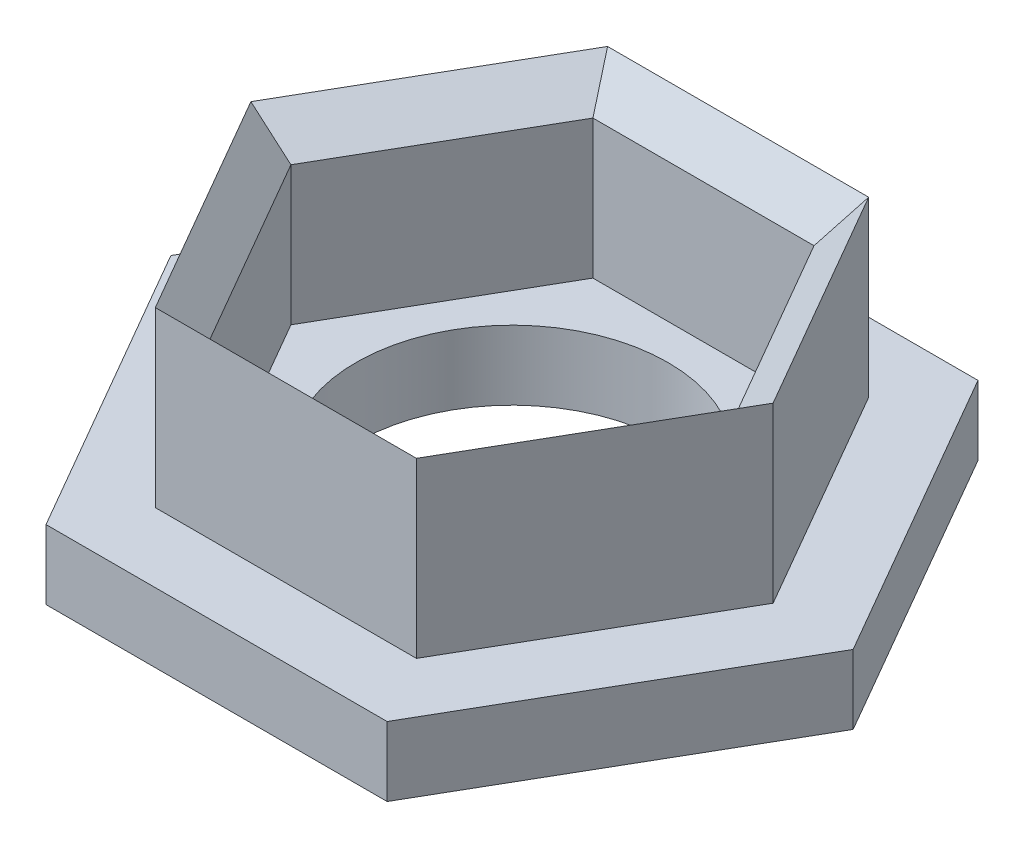
ISO-10303-21;
HEADER;
FILE_DESCRIPTION(('STEP AP214'),'2;1');
FILE_NAME('part.step','',(''),(''),'','','');
FILE_SCHEMA(('AUTOMOTIVE_DESIGN { 1 0 10303 214 1 1 1 1 }'));
ENDSEC;
DATA;
#1=APPLICATION_CONTEXT('core data for automotive mechanical design processes');
#2=APPLICATION_PROTOCOL_DEFINITION('international standard','automotive_design',2000,#1);
#3=PRODUCT_CONTEXT('',#1,'mechanical');
#4=PRODUCT('Part','Part','',(#3));
#5=PRODUCT_RELATED_PRODUCT_CATEGORY('part','',(#4));
#6=PRODUCT_DEFINITION_FORMATION('','',#4);
#7=PRODUCT_DEFINITION_CONTEXT('part definition',#1,'design');
#8=PRODUCT_DEFINITION('design','',#6,#7);
#9=PRODUCT_DEFINITION_SHAPE('','',#8);
#10=(LENGTH_UNIT() NAMED_UNIT(*) SI_UNIT(.MILLI.,.METRE.));
#11=(NAMED_UNIT(*) PLANE_ANGLE_UNIT() SI_UNIT($,.RADIAN.));
#12=(NAMED_UNIT(*) SI_UNIT($,.STERADIAN.) SOLID_ANGLE_UNIT());
#13=UNCERTAINTY_MEASURE_WITH_UNIT(LENGTH_MEASURE(1.E-05),#10,'distance_accuracy_value','');
#14=(GEOMETRIC_REPRESENTATION_CONTEXT(3) GLOBAL_UNCERTAINTY_ASSIGNED_CONTEXT((#13)) GLOBAL_UNIT_ASSIGNED_CONTEXT((#10,
#11,#12)) REPRESENTATION_CONTEXT('',''));
#15=CARTESIAN_POINT('',(0.,0.,0.));
#16=DIRECTION('',(0.,0.,1.));
#17=DIRECTION('',(1.,0.,0.));
#18=AXIS2_PLACEMENT_3D('',#15,#16,#17);
#19=CARTESIAN_POINT('',(0.,0.,0.));
#20=DIRECTION('',(0.,-1.,0.));
#21=DIRECTION('',(0.,0.,-1.));
#22=AXIS2_PLACEMENT_3D('',#19,#20,#21);
#23=PLANE('',#22);
#24=CARTESIAN_POINT('',(0.,0.,0.));
#25=DIRECTION('',(0.,-1.,0.));
#26=DIRECTION('',(0.,0.,-1.));
#27=AXIS2_PLACEMENT_3D('',#24,#25,#26);
#28=CIRCLE('',#27,4.5);
#29=CARTESIAN_POINT('',(0.,0.,-4.5));
#30=VERTEX_POINT('',#29);
#31=EDGE_CURVE('E249',#30,#30,#28,.T.);
#32=ORIENTED_EDGE('',*,*,#31,.T.);
#33=EDGE_LOOP('',(#32));
#34=FACE_BOUND('',#33,.T.);
#35=DIRECTION('',(-0.5,0.,0.866025403784439));
#36=VECTOR('',#35,1.);
#37=CARTESIAN_POINT('',(6.37972047454537,0.,0.));
#38=LINE('',#37,#36);
#39=CARTESIAN_POINT('',(6.37972047454537,0.,0.));
#40=VERTEX_POINT('',#39);
#41=CARTESIAN_POINT('',(3.18986023727269,0.,5.525));
#42=VERTEX_POINT('',#41);
#43=EDGE_CURVE('E191',#40,#42,#38,.T.);
#44=ORIENTED_EDGE('',*,*,#43,.F.);
#45=DIRECTION('',(0.5,0.,0.866025403784438));
#46=VECTOR('',#45,1.);
#47=CARTESIAN_POINT('',(3.18986023727268,0.,-5.525));
#48=LINE('',#47,#46);
#49=CARTESIAN_POINT('',(3.18986023727268,0.,-5.525));
#50=VERTEX_POINT('',#49);
#51=EDGE_CURVE('E199',#50,#40,#48,.T.);
#52=ORIENTED_EDGE('',*,*,#51,.F.);
#53=DIRECTION('',(1.,0.,0.));
#54=VECTOR('',#53,1.);
#55=CARTESIAN_POINT('',(-3.18986023727268,0.,-5.525));
#56=LINE('',#55,#54);
#57=CARTESIAN_POINT('',(-3.18986023727269,0.,-5.525));
#58=VERTEX_POINT('',#57);
#59=EDGE_CURVE('E196',#58,#50,#56,.T.);
#60=ORIENTED_EDGE('',*,*,#59,.F.);
#61=DIRECTION('',(0.5,0.,-0.866025403784438));
#62=VECTOR('',#61,1.);
#63=CARTESIAN_POINT('',(-6.37972047454537,0.,0.));
#64=LINE('',#63,#62);
#65=CARTESIAN_POINT('',(-6.37972047454537,0.,0.));
#66=VERTEX_POINT('',#65);
#67=EDGE_CURVE('E187',#66,#58,#64,.T.);
#68=ORIENTED_EDGE('',*,*,#67,.F.);
#69=DIRECTION('',(-0.5,0.,-0.866025403784439));
#70=VECTOR('',#69,1.);
#71=CARTESIAN_POINT('',(-3.18986023727268,0.,5.525));
#72=LINE('',#71,#70);
#73=CARTESIAN_POINT('',(-3.18986023727268,0.,5.525));
#74=VERTEX_POINT('',#73);
#75=EDGE_CURVE('E169',#74,#66,#72,.T.);
#76=ORIENTED_EDGE('',*,*,#75,.F.);
#77=DIRECTION('',(-1.,0.,0.));
#78=VECTOR('',#77,1.);
#79=CARTESIAN_POINT('',(3.18986023727269,0.,5.525));
#80=LINE('',#79,#78);
#81=EDGE_CURVE('E183',#42,#74,#80,.T.);
#82=ORIENTED_EDGE('',*,*,#81,.F.);
#83=EDGE_LOOP('',(#44,#52,#60,#68,#76,#82));
#84=FACE_BOUND('',#83,.T.);
#85=ADVANCED_FACE('F38',(#34,#84),#23,.F.);
#86=CARTESIAN_POINT('',(0.,-2.,0.));
#87=DIRECTION('',(0.,-1.,0.));
#88=DIRECTION('',(0.,0.,-1.));
#89=AXIS2_PLACEMENT_3D('',#86,#87,#88);
#90=PLANE('',#89);
#91=DIRECTION('',(0.5,0.,-0.866025403784439));
#92=VECTOR('',#91,1.);
#93=CARTESIAN_POINT('',(-9.84382208968312,-2.,0.));
#94=LINE('',#93,#92);
#95=CARTESIAN_POINT('',(-9.84382208968312,-2.,0.));
#96=VERTEX_POINT('',#95);
#97=CARTESIAN_POINT('',(-4.92191104484156,-2.,-8.525));
#98=VERTEX_POINT('',#97);
#99=EDGE_CURVE('E266',#96,#98,#94,.T.);
#100=ORIENTED_EDGE('',*,*,#99,.T.);
#101=DIRECTION('',(1.,0.,0.));
#102=VECTOR('',#101,1.);
#103=CARTESIAN_POINT('',(-4.92191104484156,-2.,-8.525));
#104=LINE('',#103,#102);
#105=CARTESIAN_POINT('',(4.92191104484156,-2.,-8.525));
#106=VERTEX_POINT('',#105);
#107=EDGE_CURVE('E269',#98,#106,#104,.T.);
#108=ORIENTED_EDGE('',*,*,#107,.T.);
#109=DIRECTION('',(0.5,0.,0.866025403784438));
#110=VECTOR('',#109,1.);
#111=CARTESIAN_POINT('',(4.92191104484156,-2.,-8.525));
#112=LINE('',#111,#110);
#113=CARTESIAN_POINT('',(9.84382208968312,-2.,0.));
#114=VERTEX_POINT('',#113);
#115=EDGE_CURVE('E272',#106,#114,#112,.T.);
#116=ORIENTED_EDGE('',*,*,#115,.T.);
#117=DIRECTION('',(-0.5,0.,0.866025403784439));
#118=VECTOR('',#117,1.);
#119=CARTESIAN_POINT('',(9.84382208968312,-2.,0.));
#120=LINE('',#119,#118);
#121=CARTESIAN_POINT('',(4.92191104484157,-2.,8.525));
#122=VERTEX_POINT('',#121);
#123=EDGE_CURVE('E274',#114,#122,#120,.T.);
#124=ORIENTED_EDGE('',*,*,#123,.T.);
#125=DIRECTION('',(-1.,0.,0.));
#126=VECTOR('',#125,1.);
#127=CARTESIAN_POINT('',(4.92191104484157,-2.,8.525));
#128=LINE('',#127,#126);
#129=CARTESIAN_POINT('',(-4.92191104484156,-2.,8.525));
#130=VERTEX_POINT('',#129);
#131=EDGE_CURVE('E276',#122,#130,#128,.T.);
#132=ORIENTED_EDGE('',*,*,#131,.T.);
#133=DIRECTION('',(-0.5,0.,-0.866025403784438));
#134=VECTOR('',#133,1.);
#135=CARTESIAN_POINT('',(-4.92191104484156,-2.,8.525));
#136=LINE('',#135,#134);
#137=EDGE_CURVE('E278',#130,#96,#136,.T.);
#138=ORIENTED_EDGE('',*,*,#137,.T.);
#139=EDGE_LOOP('',(#100,#108,#116,#124,#132,#138));
#140=FACE_BOUND('',#139,.T.);
#141=CARTESIAN_POINT('',(0.,-2.,0.));
#142=DIRECTION('',(0.,-1.,0.));
#143=DIRECTION('',(0.,0.,-1.));
#144=AXIS2_PLACEMENT_3D('',#141,#142,#143);
#145=CIRCLE('',#144,4.5);
#146=CARTESIAN_POINT('',(0.,-2.,-4.5));
#147=VERTEX_POINT('',#146);
#148=EDGE_CURVE('E260',#147,#147,#145,.T.);
#149=ORIENTED_EDGE('',*,*,#148,.F.);
#150=EDGE_LOOP('',(#149));
#151=FACE_BOUND('',#150,.T.);
#152=ADVANCED_FACE('F383',(#140,#151),#90,.T.);
#153=DIRECTION('',(1.,0.,0.));
#154=VECTOR('',#153,1.);
#155=CARTESIAN_POINT('',(-3.76721050646231,0.,-6.525));
#156=LINE('',#155,#154);
#157=CARTESIAN_POINT('',(-3.76721050646231,0.,-6.525));
#158=VERTEX_POINT('',#157);
#159=CARTESIAN_POINT('',(3.76721050646231,0.,-6.525));
#160=VERTEX_POINT('',#159);
#161=EDGE_CURVE('E215',#158,#160,#156,.T.);
#162=ORIENTED_EDGE('',*,*,#161,.T.);
#163=DIRECTION('',(0.5,0.,0.866025403784439));
#164=VECTOR('',#163,1.);
#165=CARTESIAN_POINT('',(3.76721050646231,0.,-6.525));
#166=LINE('',#165,#164);
#167=CARTESIAN_POINT('',(7.53442101292462,0.,0.));
#168=VERTEX_POINT('',#167);
#169=EDGE_CURVE('E204',#160,#168,#166,.T.);
#170=ORIENTED_EDGE('',*,*,#169,.T.);
#171=DIRECTION('',(-0.5,0.,0.866025403784439));
#172=VECTOR('',#171,1.);
#173=CARTESIAN_POINT('',(7.53442101292462,0.,0.));
#174=LINE('',#173,#172);
#175=CARTESIAN_POINT('',(3.76721050646231,0.,6.525));
#176=VERTEX_POINT('',#175);
#177=EDGE_CURVE('E233',#168,#176,#174,.T.);
#178=ORIENTED_EDGE('',*,*,#177,.T.);
#179=DIRECTION('',(-1.,0.,0.));
#180=VECTOR('',#179,1.);
#181=CARTESIAN_POINT('',(3.76721050646231,0.,6.525));
#182=LINE('',#181,#180);
#183=CARTESIAN_POINT('',(-3.76721050646231,0.,6.525));
#184=VERTEX_POINT('',#183);
#185=EDGE_CURVE('E236',#176,#184,#182,.T.);
#186=ORIENTED_EDGE('',*,*,#185,.T.);
#187=DIRECTION('',(-0.5,0.,-0.866025403784439));
#188=VECTOR('',#187,1.);
#189=CARTESIAN_POINT('',(-3.76721050646231,0.,6.525));
#190=LINE('',#189,#188);
#191=CARTESIAN_POINT('',(-7.53442101292462,0.,0.));
#192=VERTEX_POINT('',#191);
#193=EDGE_CURVE('E239',#184,#192,#190,.T.);
#194=ORIENTED_EDGE('',*,*,#193,.T.);
#195=DIRECTION('',(0.5,0.,-0.866025403784438));
#196=VECTOR('',#195,1.);
#197=CARTESIAN_POINT('',(-7.53442101292462,0.,0.));
#198=LINE('',#197,#196);
#199=EDGE_CURVE('E242',#192,#158,#198,.T.);
#200=ORIENTED_EDGE('',*,*,#199,.T.);
#201=EDGE_LOOP('',(#162,#170,#178,#186,#194,#200));
#202=FACE_BOUND('',#201,.T.);
#203=DIRECTION('',(0.5,0.,-0.866025403784439));
#204=VECTOR('',#203,1.);
#205=CARTESIAN_POINT('',(-9.84382208968312,0.,0.));
#206=LINE('',#205,#204);
#207=CARTESIAN_POINT('',(-9.84382208968312,0.,0.));
#208=VERTEX_POINT('',#207);
#209=CARTESIAN_POINT('',(-4.92191104484156,0.,-8.525));
#210=VERTEX_POINT('',#209);
#211=EDGE_CURVE('E263',#208,#210,#206,.T.);
#212=ORIENTED_EDGE('',*,*,#211,.F.);
#213=DIRECTION('',(-0.5,0.,-0.866025403784438));
#214=VECTOR('',#213,1.);
#215=CARTESIAN_POINT('',(-4.92191104484156,0.,8.525));
#216=LINE('',#215,#214);
#217=CARTESIAN_POINT('',(-4.92191104484156,0.,8.525));
#218=VERTEX_POINT('',#217);
#219=EDGE_CURVE('E270',#218,#208,#216,.T.);
#220=ORIENTED_EDGE('',*,*,#219,.F.);
#221=DIRECTION('',(-1.,0.,0.));
#222=VECTOR('',#221,1.);
#223=CARTESIAN_POINT('',(4.92191104484157,0.,8.525));
#224=LINE('',#223,#222);
#225=CARTESIAN_POINT('',(4.92191104484157,0.,8.525));
#226=VERTEX_POINT('',#225);
#227=EDGE_CURVE('E289',#226,#218,#224,.T.);
#228=ORIENTED_EDGE('',*,*,#227,.F.);
#229=DIRECTION('',(-0.5,0.,0.866025403784439));
#230=VECTOR('',#229,1.);
#231=CARTESIAN_POINT('',(9.84382208968312,0.,0.));
#232=LINE('',#231,#230);
#233=CARTESIAN_POINT('',(9.84382208968312,0.,0.));
#234=VERTEX_POINT('',#233);
#235=EDGE_CURVE('E287',#234,#226,#232,.T.);
#236=ORIENTED_EDGE('',*,*,#235,.F.);
#237=DIRECTION('',(0.5,0.,0.866025403784438));
#238=VECTOR('',#237,1.);
#239=CARTESIAN_POINT('',(4.92191104484156,0.,-8.525));
#240=LINE('',#239,#238);
#241=CARTESIAN_POINT('',(4.92191104484156,0.,-8.525));
#242=VERTEX_POINT('',#241);
#243=EDGE_CURVE('E285',#242,#234,#240,.T.);
#244=ORIENTED_EDGE('',*,*,#243,.F.);
#245=DIRECTION('',(1.,0.,0.));
#246=VECTOR('',#245,1.);
#247=CARTESIAN_POINT('',(-4.92191104484156,0.,-8.525));
#248=LINE('',#247,#246);
#249=EDGE_CURVE('E283',#210,#242,#248,.T.);
#250=ORIENTED_EDGE('',*,*,#249,.F.);
#251=EDGE_LOOP('',(#212,#220,#228,#236,#244,#250));
#252=FACE_BOUND('',#251,.T.);
#253=ADVANCED_FACE('F379',(#202,#252),#23,.F.);
#254=CARTESIAN_POINT('',(-9.84382208968312,-2.,0.));
#255=DIRECTION('',(0.866025403784439,0.,0.5));
#256=DIRECTION('',(0.5,0.,-0.866025403784439));
#257=AXIS2_PLACEMENT_3D('',#254,#255,#256);
#258=PLANE('',#257);
#259=ORIENTED_EDGE('',*,*,#211,.T.);
#260=DIRECTION('',(0.,1.,0.));
#261=VECTOR('',#260,1.);
#262=CARTESIAN_POINT('',(-4.92191104484156,-2.,-8.525));
#263=LINE('',#262,#261);
#264=EDGE_CURVE('E306',#98,#210,#263,.T.);
#265=ORIENTED_EDGE('',*,*,#264,.F.);
#266=ORIENTED_EDGE('',*,*,#99,.F.);
#267=DIRECTION('',(0.,1.,0.));
#268=VECTOR('',#267,1.);
#269=CARTESIAN_POINT('',(-9.84382208968312,-2.,0.));
#270=LINE('',#269,#268);
#271=EDGE_CURVE('E280',#96,#208,#270,.T.);
#272=ORIENTED_EDGE('',*,*,#271,.T.);
#273=EDGE_LOOP('',(#259,#265,#266,#272));
#274=FACE_BOUND('',#273,.T.);
#275=ADVANCED_FACE('F382',(#274),#258,.F.);
#276=CARTESIAN_POINT('',(-4.92191104484156,-2.,-8.525));
#277=DIRECTION('',(0.,0.,1.));
#278=DIRECTION('',(1.,0.,0.));
#279=AXIS2_PLACEMENT_3D('',#276,#277,#278);
#280=PLANE('',#279);
#281=ORIENTED_EDGE('',*,*,#249,.T.);
#282=DIRECTION('',(0.,1.,0.));
#283=VECTOR('',#282,1.);
#284=CARTESIAN_POINT('',(4.92191104484156,-2.,-8.525));
#285=LINE('',#284,#283);
#286=EDGE_CURVE('E303',#106,#242,#285,.T.);
#287=ORIENTED_EDGE('',*,*,#286,.F.);
#288=ORIENTED_EDGE('',*,*,#107,.F.);
#289=ORIENTED_EDGE('',*,*,#264,.T.);
#290=EDGE_LOOP('',(#281,#287,#288,#289));
#291=FACE_BOUND('',#290,.T.);
#292=ADVANCED_FACE('F411',(#291),#280,.F.);
#293=CARTESIAN_POINT('',(4.92191104484156,-2.,-8.525));
#294=DIRECTION('',(-0.866025403784438,0.,0.5));
#295=DIRECTION('',(0.5,0.,0.866025403784438));
#296=AXIS2_PLACEMENT_3D('',#293,#294,#295);
#297=PLANE('',#296);
#298=ORIENTED_EDGE('',*,*,#243,.T.);
#299=DIRECTION('',(0.,1.,0.));
#300=VECTOR('',#299,1.);
#301=CARTESIAN_POINT('',(9.84382208968312,-2.,0.));
#302=LINE('',#301,#300);
#303=EDGE_CURVE('E300',#114,#234,#302,.T.);
#304=ORIENTED_EDGE('',*,*,#303,.F.);
#305=ORIENTED_EDGE('',*,*,#115,.F.);
#306=ORIENTED_EDGE('',*,*,#286,.T.);
#307=EDGE_LOOP('',(#298,#304,#305,#306));
#308=FACE_BOUND('',#307,.T.);
#309=ADVANCED_FACE('F408',(#308),#297,.F.);
#310=CARTESIAN_POINT('',(9.84382208968312,-2.,0.));
#311=DIRECTION('',(-0.866025403784439,0.,-0.5));
#312=DIRECTION('',(-0.5,0.,0.866025403784439));
#313=AXIS2_PLACEMENT_3D('',#310,#311,#312);
#314=PLANE('',#313);
#315=ORIENTED_EDGE('',*,*,#235,.T.);
#316=DIRECTION('',(0.,1.,0.));
#317=VECTOR('',#316,1.);
#318=CARTESIAN_POINT('',(4.92191104484157,-2.,8.525));
#319=LINE('',#318,#317);
#320=EDGE_CURVE('E297',#122,#226,#319,.T.);
#321=ORIENTED_EDGE('',*,*,#320,.F.);
#322=ORIENTED_EDGE('',*,*,#123,.F.);
#323=ORIENTED_EDGE('',*,*,#303,.T.);
#324=EDGE_LOOP('',(#315,#321,#322,#323));
#325=FACE_BOUND('',#324,.T.);
#326=ADVANCED_FACE('F403',(#325),#314,.F.);
#327=CARTESIAN_POINT('',(4.92191104484157,-2.,8.525));
#328=DIRECTION('',(0.,0.,-1.));
#329=DIRECTION('',(-1.,0.,0.));
#330=AXIS2_PLACEMENT_3D('',#327,#328,#329);
#331=PLANE('',#330);
#332=ORIENTED_EDGE('',*,*,#227,.T.);
#333=DIRECTION('',(0.,1.,0.));
#334=VECTOR('',#333,1.);
#335=CARTESIAN_POINT('',(-4.92191104484156,-2.,8.525));
#336=LINE('',#335,#334);
#337=EDGE_CURVE('E294',#130,#218,#336,.T.);
#338=ORIENTED_EDGE('',*,*,#337,.F.);
#339=ORIENTED_EDGE('',*,*,#131,.F.);
#340=ORIENTED_EDGE('',*,*,#320,.T.);
#341=EDGE_LOOP('',(#332,#338,#339,#340));
#342=FACE_BOUND('',#341,.T.);
#343=ADVANCED_FACE('F399',(#342),#331,.F.);
#344=CARTESIAN_POINT('',(-4.92191104484156,-2.,8.525));
#345=DIRECTION('',(0.866025403784438,0.,-0.5));
#346=DIRECTION('',(-0.5,0.,-0.866025403784439));
#347=AXIS2_PLACEMENT_3D('',#344,#345,#346);
#348=PLANE('',#347);
#349=ORIENTED_EDGE('',*,*,#219,.T.);
#350=ORIENTED_EDGE('',*,*,#271,.F.);
#351=ORIENTED_EDGE('',*,*,#137,.F.);
#352=ORIENTED_EDGE('',*,*,#337,.T.);
#353=EDGE_LOOP('',(#349,#350,#351,#352));
#354=FACE_BOUND('',#353,.T.);
#355=ADVANCED_FACE('F395',(#354),#348,.F.);
#356=CARTESIAN_POINT('',(0.,-2.,0.));
#357=DIRECTION('',(0.,1.,0.));
#358=DIRECTION('',(0.,0.,1.));
#359=AXIS2_PLACEMENT_3D('',#356,#357,#358);
#360=CYLINDRICAL_SURFACE('',#359,4.5);
#361=ORIENTED_EDGE('',*,*,#148,.T.);
#362=EDGE_LOOP('',(#361));
#363=FACE_BOUND('',#362,.T.);
#364=ORIENTED_EDGE('',*,*,#31,.F.);
#365=EDGE_LOOP('',(#364));
#366=FACE_BOUND('',#365,.T.);
#367=ADVANCED_FACE('F418',(#363,#366),#360,.F.);
#368=CARTESIAN_POINT('',(3.76721050646231,5.,-6.525));
#369=DIRECTION('',(0.866025403784439,0.,-0.5));
#370=DIRECTION('',(-0.5,0.,-0.866025403784439));
#371=AXIS2_PLACEMENT_3D('',#368,#369,#370);
#372=PLANE('',#371);
#373=ORIENTED_EDGE('',*,*,#169,.F.);
#374=DIRECTION('',(0.,-1.,0.));
#375=VECTOR('',#374,1.);
#376=CARTESIAN_POINT('',(3.76721050646231,5.,-6.525));
#377=LINE('',#376,#375);
#378=CARTESIAN_POINT('',(3.76721050646231,5.,-6.525));
#379=VERTEX_POINT('',#378);
#380=EDGE_CURVE('E247',#379,#160,#377,.T.);
#381=ORIENTED_EDGE('',*,*,#380,.F.);
#382=DIRECTION('',(0.5,0.,0.866025403784439));
#383=VECTOR('',#382,1.);
#384=CARTESIAN_POINT('',(3.76721050646231,5.,-6.525));
#385=LINE('',#384,#383);
#386=CARTESIAN_POINT('',(7.53442101292462,5.,0.));
#387=VERTEX_POINT('',#386);
#388=EDGE_CURVE('E211',#379,#387,#385,.T.);
#389=ORIENTED_EDGE('',*,*,#388,.T.);
#390=DIRECTION('',(0.,-1.,0.));
#391=VECTOR('',#390,1.);
#392=CARTESIAN_POINT('',(7.53442101292462,5.,0.));
#393=LINE('',#392,#391);
#394=EDGE_CURVE('E230',#387,#168,#393,.T.);
#395=ORIENTED_EDGE('',*,*,#394,.T.);
#396=EDGE_LOOP('',(#373,#381,#389,#395));
#397=FACE_BOUND('',#396,.T.);
#398=ADVANCED_FACE('F371',(#397),#372,.T.);
#399=CARTESIAN_POINT('',(-3.76721050646231,5.,-6.525));
#400=DIRECTION('',(0.,0.,-1.));
#401=DIRECTION('',(-1.,0.,0.));
#402=AXIS2_PLACEMENT_3D('',#399,#400,#401);
#403=PLANE('',#402);
#404=ORIENTED_EDGE('',*,*,#161,.F.);
#405=DIRECTION('',(0.,-1.,0.));
#406=VECTOR('',#405,1.);
#407=CARTESIAN_POINT('',(-3.76721050646231,5.,-6.525));
#408=LINE('',#407,#406);
#409=CARTESIAN_POINT('',(-3.76721050646231,5.,-6.525));
#410=VERTEX_POINT('',#409);
#411=EDGE_CURVE('E250',#410,#158,#408,.T.);
#412=ORIENTED_EDGE('',*,*,#411,.F.);
#413=DIRECTION('',(1.,0.,0.));
#414=VECTOR('',#413,1.);
#415=CARTESIAN_POINT('',(-3.76721050646231,5.,-6.525));
#416=LINE('',#415,#414);
#417=EDGE_CURVE('E227',#410,#379,#416,.T.);
#418=ORIENTED_EDGE('',*,*,#417,.T.);
#419=ORIENTED_EDGE('',*,*,#380,.T.);
#420=EDGE_LOOP('',(#404,#412,#418,#419));
#421=FACE_BOUND('',#420,.T.);
#422=ADVANCED_FACE('F374',(#421),#403,.T.);
#423=CARTESIAN_POINT('',(-7.53442101292462,5.,0.));
#424=DIRECTION('',(-0.866025403784439,0.,-0.5));
#425=DIRECTION('',(-0.5,0.,0.866025403784439));
#426=AXIS2_PLACEMENT_3D('',#423,#424,#425);
#427=PLANE('',#426);
#428=ORIENTED_EDGE('',*,*,#199,.F.);
#429=DIRECTION('',(0.,-1.,0.));
#430=VECTOR('',#429,1.);
#431=CARTESIAN_POINT('',(-7.53442101292462,5.,0.));
#432=LINE('',#431,#430);
#433=CARTESIAN_POINT('',(-7.53442101292462,5.,0.));
#434=VERTEX_POINT('',#433);
#435=EDGE_CURVE('E252',#434,#192,#432,.T.);
#436=ORIENTED_EDGE('',*,*,#435,.F.);
#437=DIRECTION('',(0.5,0.,-0.866025403784438));
#438=VECTOR('',#437,1.);
#439=CARTESIAN_POINT('',(-7.53442101292462,5.,0.));
#440=LINE('',#439,#438);
#441=EDGE_CURVE('E224',#434,#410,#440,.T.);
#442=ORIENTED_EDGE('',*,*,#441,.T.);
#443=ORIENTED_EDGE('',*,*,#411,.T.);
#444=EDGE_LOOP('',(#428,#436,#442,#443));
#445=FACE_BOUND('',#444,.T.);
#446=ADVANCED_FACE('F377',(#445),#427,.T.);
#447=CARTESIAN_POINT('',(-3.76721050646231,5.,6.525));
#448=DIRECTION('',(-0.866025403784439,0.,0.5));
#449=DIRECTION('',(0.5,0.,0.866025403784439));
#450=AXIS2_PLACEMENT_3D('',#447,#448,#449);
#451=PLANE('',#450);
#452=ORIENTED_EDGE('',*,*,#193,.F.);
#453=DIRECTION('',(0.,-1.,0.));
#454=VECTOR('',#453,1.);
#455=CARTESIAN_POINT('',(-3.76721050646231,5.,6.525));
#456=LINE('',#455,#454);
#457=CARTESIAN_POINT('',(-3.76721050646231,5.,6.525));
#458=VERTEX_POINT('',#457);
#459=EDGE_CURVE('E254',#458,#184,#456,.T.);
#460=ORIENTED_EDGE('',*,*,#459,.F.);
#461=DIRECTION('',(-0.5,0.,-0.866025403784439));
#462=VECTOR('',#461,1.);
#463=CARTESIAN_POINT('',(-3.76721050646231,5.,6.525));
#464=LINE('',#463,#462);
#465=EDGE_CURVE('E221',#458,#434,#464,.T.);
#466=ORIENTED_EDGE('',*,*,#465,.T.);
#467=ORIENTED_EDGE('',*,*,#435,.T.);
#468=EDGE_LOOP('',(#452,#460,#466,#467));
#469=FACE_BOUND('',#468,.T.);
#470=ADVANCED_FACE('F363',(#469),#451,.T.);
#471=CARTESIAN_POINT('',(3.76721050646231,5.,6.525));
#472=DIRECTION('',(0.,0.,1.));
#473=DIRECTION('',(1.,0.,0.));
#474=AXIS2_PLACEMENT_3D('',#471,#472,#473);
#475=PLANE('',#474);
#476=ORIENTED_EDGE('',*,*,#185,.F.);
#477=DIRECTION('',(0.,-1.,0.));
#478=VECTOR('',#477,1.);
#479=CARTESIAN_POINT('',(3.76721050646231,5.,6.525));
#480=LINE('',#479,#478);
#481=CARTESIAN_POINT('',(3.76721050646231,5.,6.525));
#482=VERTEX_POINT('',#481);
#483=EDGE_CURVE('E256',#482,#176,#480,.T.);
#484=ORIENTED_EDGE('',*,*,#483,.F.);
#485=DIRECTION('',(-1.,0.,0.));
#486=VECTOR('',#485,1.);
#487=CARTESIAN_POINT('',(3.76721050646231,5.,6.525));
#488=LINE('',#487,#486);
#489=EDGE_CURVE('E218',#482,#458,#488,.T.);
#490=ORIENTED_EDGE('',*,*,#489,.T.);
#491=ORIENTED_EDGE('',*,*,#459,.T.);
#492=EDGE_LOOP('',(#476,#484,#490,#491));
#493=FACE_BOUND('',#492,.T.);
#494=ADVANCED_FACE('F365',(#493),#475,.T.);
#495=CARTESIAN_POINT('',(7.53442101292462,5.,0.));
#496=DIRECTION('',(0.866025403784439,0.,0.5));
#497=DIRECTION('',(0.5,0.,-0.866025403784439));
#498=AXIS2_PLACEMENT_3D('',#495,#496,#497);
#499=PLANE('',#498);
#500=ORIENTED_EDGE('',*,*,#177,.F.);
#501=ORIENTED_EDGE('',*,*,#394,.F.);
#502=DIRECTION('',(-0.5,0.,0.866025403784439));
#503=VECTOR('',#502,1.);
#504=CARTESIAN_POINT('',(7.53442101292462,5.,0.));
#505=LINE('',#504,#503);
#506=EDGE_CURVE('E214',#387,#482,#505,.T.);
#507=ORIENTED_EDGE('',*,*,#506,.T.);
#508=ORIENTED_EDGE('',*,*,#483,.T.);
#509=EDGE_LOOP('',(#500,#501,#507,#508));
#510=FACE_BOUND('',#509,.T.);
#511=ADVANCED_FACE('F368',(#510),#499,.T.);
#512=CARTESIAN_POINT('',(6.37972047454537,5.,0.));
#513=DIRECTION('',(0.866025403784439,0.,0.5));
#514=DIRECTION('',(0.5,0.,-0.866025403784439));
#515=AXIS2_PLACEMENT_3D('',#512,#513,#514);
#516=PLANE('',#515);
#517=DIRECTION('',(0.,-1.,0.));
#518=VECTOR('',#517,1.);
#519=CARTESIAN_POINT('',(3.18986023727269,5.,5.525));
#520=LINE('',#519,#518);
#521=CARTESIAN_POINT('',(3.18986023727269,4.,5.525));
#522=VERTEX_POINT('',#521);
#523=EDGE_CURVE('E177',#522,#42,#520,.T.);
#524=ORIENTED_EDGE('',*,*,#523,.F.);
#525=DIRECTION('',(0.5,0.,-0.866025403784439));
#526=VECTOR('',#525,1.);
#527=CARTESIAN_POINT('',(6.37972047454537,4.,0.));
#528=LINE('',#527,#526);
#529=CARTESIAN_POINT('',(6.37972047454537,4.,0.));
#530=VERTEX_POINT('',#529);
#531=EDGE_CURVE('E312',#522,#530,#528,.T.);
#532=ORIENTED_EDGE('',*,*,#531,.T.);
#533=DIRECTION('',(0.,-1.,0.));
#534=VECTOR('',#533,1.);
#535=CARTESIAN_POINT('',(6.37972047454537,5.,0.));
#536=LINE('',#535,#534);
#537=EDGE_CURVE('E202',#530,#40,#536,.T.);
#538=ORIENTED_EDGE('',*,*,#537,.T.);
#539=ORIENTED_EDGE('',*,*,#43,.T.);
#540=EDGE_LOOP('',(#524,#532,#538,#539));
#541=FACE_BOUND('',#540,.T.);
#542=ADVANCED_FACE('F347',(#541),#516,.F.);
#543=CARTESIAN_POINT('',(3.18986023727268,5.,-5.525));
#544=DIRECTION('',(0.866025403784438,0.,-0.5));
#545=DIRECTION('',(-0.5,0.,-0.866025403784439));
#546=AXIS2_PLACEMENT_3D('',#543,#544,#545);
#547=PLANE('',#546);
#548=ORIENTED_EDGE('',*,*,#537,.F.);
#549=DIRECTION('',(-0.5,0.,-0.866025403784439));
#550=VECTOR('',#549,1.);
#551=CARTESIAN_POINT('',(3.18986023727268,4.,-5.525));
#552=LINE('',#551,#550);
#553=CARTESIAN_POINT('',(3.18986023727268,4.,-5.525));
#554=VERTEX_POINT('',#553);
#555=EDGE_CURVE('E63',#530,#554,#552,.T.);
#556=ORIENTED_EDGE('',*,*,#555,.T.);
#557=DIRECTION('',(0.,-1.,0.));
#558=VECTOR('',#557,1.);
#559=CARTESIAN_POINT('',(3.18986023727268,5.,-5.525));
#560=LINE('',#559,#558);
#561=EDGE_CURVE('E205',#554,#50,#560,.T.);
#562=ORIENTED_EDGE('',*,*,#561,.T.);
#563=ORIENTED_EDGE('',*,*,#51,.T.);
#564=EDGE_LOOP('',(#548,#556,#562,#563));
#565=FACE_BOUND('',#564,.T.);
#566=ADVANCED_FACE('F345',(#565),#547,.F.);
#567=CARTESIAN_POINT('',(-3.18986023727268,5.,-5.525));
#568=DIRECTION('',(0.,0.,-1.));
#569=DIRECTION('',(-1.,0.,0.));
#570=AXIS2_PLACEMENT_3D('',#567,#568,#569);
#571=PLANE('',#570);
#572=ORIENTED_EDGE('',*,*,#561,.F.);
#573=DIRECTION('',(-1.,0.,0.));
#574=VECTOR('',#573,1.);
#575=CARTESIAN_POINT('',(-3.18986023727268,4.,-5.525));
#576=LINE('',#575,#574);
#577=CARTESIAN_POINT('',(-3.18986023727268,4.,-5.525));
#578=VERTEX_POINT('',#577);
#579=EDGE_CURVE('E48',#554,#578,#576,.T.);
#580=ORIENTED_EDGE('',*,*,#579,.T.);
#581=DIRECTION('',(0.,-1.,0.));
#582=VECTOR('',#581,1.);
#583=CARTESIAN_POINT('',(-3.18986023727268,5.,-5.525));
#584=LINE('',#583,#582);
#585=EDGE_CURVE('E207',#578,#58,#584,.T.);
#586=ORIENTED_EDGE('',*,*,#585,.T.);
#587=ORIENTED_EDGE('',*,*,#59,.T.);
#588=EDGE_LOOP('',(#572,#580,#586,#587));
#589=FACE_BOUND('',#588,.T.);
#590=ADVANCED_FACE('F343',(#589),#571,.F.);
#591=CARTESIAN_POINT('',(-6.37972047454537,5.,0.));
#592=DIRECTION('',(-0.866025403784439,0.,-0.5));
#593=DIRECTION('',(-0.5,0.,0.866025403784439));
#594=AXIS2_PLACEMENT_3D('',#591,#592,#593);
#595=PLANE('',#594);
#596=ORIENTED_EDGE('',*,*,#585,.F.);
#597=DIRECTION('',(-0.5,0.,0.866025403784439));
#598=VECTOR('',#597,1.);
#599=CARTESIAN_POINT('',(-6.37972047454537,4.,0.));
#600=LINE('',#599,#598);
#601=CARTESIAN_POINT('',(-6.37972047454537,4.,0.));
#602=VERTEX_POINT('',#601);
#603=EDGE_CURVE('E11',#578,#602,#600,.T.);
#604=ORIENTED_EDGE('',*,*,#603,.T.);
#605=DIRECTION('',(0.,-1.,0.));
#606=VECTOR('',#605,1.);
#607=CARTESIAN_POINT('',(-6.37972047454537,5.,0.));
#608=LINE('',#607,#606);
#609=EDGE_CURVE('E176',#602,#66,#608,.T.);
#610=ORIENTED_EDGE('',*,*,#609,.T.);
#611=ORIENTED_EDGE('',*,*,#67,.T.);
#612=EDGE_LOOP('',(#596,#604,#610,#611));
#613=FACE_BOUND('',#612,.T.);
#614=ADVANCED_FACE('F342',(#613),#595,.F.);
#615=CARTESIAN_POINT('',(-3.18986023727268,5.,5.525));
#616=DIRECTION('',(-0.866025403784438,0.,0.5));
#617=DIRECTION('',(0.5,0.,0.866025403784439));
#618=AXIS2_PLACEMENT_3D('',#615,#616,#617);
#619=PLANE('',#618);
#620=ORIENTED_EDGE('',*,*,#609,.F.);
#621=DIRECTION('',(0.5,0.,0.866025403784439));
#622=VECTOR('',#621,1.);
#623=CARTESIAN_POINT('',(-3.18986023727268,4.,5.525));
#624=LINE('',#623,#622);
#625=CARTESIAN_POINT('',(-3.18986023727268,4.,5.525));
#626=VERTEX_POINT('',#625);
#627=EDGE_CURVE('E171',#602,#626,#624,.T.);
#628=ORIENTED_EDGE('',*,*,#627,.T.);
#629=DIRECTION('',(0.,-1.,0.));
#630=VECTOR('',#629,1.);
#631=CARTESIAN_POINT('',(-3.18986023727268,5.,5.525));
#632=LINE('',#631,#630);
#633=EDGE_CURVE('E165',#626,#74,#632,.T.);
#634=ORIENTED_EDGE('',*,*,#633,.T.);
#635=ORIENTED_EDGE('',*,*,#75,.T.);
#636=EDGE_LOOP('',(#620,#628,#634,#635));
#637=FACE_BOUND('',#636,.T.);
#638=ADVANCED_FACE('F168',(#637),#619,.F.);
#639=CARTESIAN_POINT('',(3.18986023727269,5.,5.525));
#640=DIRECTION('',(0.,0.,1.));
#641=DIRECTION('',(1.,0.,0.));
#642=AXIS2_PLACEMENT_3D('',#639,#640,#641);
#643=PLANE('',#642);
#644=ORIENTED_EDGE('',*,*,#633,.F.);
#645=DIRECTION('',(1.,0.,0.));
#646=VECTOR('',#645,1.);
#647=CARTESIAN_POINT('',(3.18986023727269,4.,5.525));
#648=LINE('',#647,#646);
#649=EDGE_CURVE('E309',#626,#522,#648,.T.);
#650=ORIENTED_EDGE('',*,*,#649,.T.);
#651=ORIENTED_EDGE('',*,*,#523,.T.);
#652=ORIENTED_EDGE('',*,*,#81,.T.);
#653=EDGE_LOOP('',(#644,#650,#651,#652));
#654=FACE_BOUND('',#653,.T.);
#655=ADVANCED_FACE('F189',(#654),#643,.F.);
#656=CARTESIAN_POINT('',(0.,5.,-6.525));
#657=DIRECTION('',(0.,-0.707106781186546,-0.707106781186549));
#658=DIRECTION('',(1.,0.,0.));
#659=AXIS2_PLACEMENT_3D('',#656,#657,#658);
#660=PLANE('',#659);
#661=DIRECTION('',(-0.377964473009227,0.654653670707979,-0.654653670707976));
#662=VECTOR('',#661,1.);
#663=CARTESIAN_POINT('',(-3.22903757696769,4.06785714285714,-5.59285714285714));
#664=LINE('',#663,#662);
#665=EDGE_CURVE('E325',#578,#410,#664,.T.);
#666=ORIENTED_EDGE('',*,*,#665,.F.);
#667=ORIENTED_EDGE('',*,*,#579,.F.);
#668=DIRECTION('',(0.377964473009227,0.654653670707979,-0.654653670707976));
#669=VECTOR('',#668,1.);
#670=CARTESIAN_POINT('',(3.22903757696769,4.06785714285714,-5.59285714285715));
#671=LINE('',#670,#669);
#672=EDGE_CURVE('E43',#379,#554,#671,.F.);
#673=ORIENTED_EDGE('',*,*,#672,.F.);
#674=ORIENTED_EDGE('',*,*,#417,.F.);
#675=EDGE_LOOP('',(#666,#667,#673,#674));
#676=FACE_BOUND('',#675,.T.);
#677=ADVANCED_FACE('F41',(#676),#660,.F.);
#678=CARTESIAN_POINT('',(5.65081575969346,5.,-3.2625));
#679=DIRECTION('',(0.612372435695796,-0.707106781186546,-0.353553390593275));
#680=DIRECTION('',(0.5,0.,0.866025403784439));
#681=AXIS2_PLACEMENT_3D('',#678,#679,#680);
#682=PLANE('',#681);
#683=ORIENTED_EDGE('',*,*,#672,.T.);
#684=ORIENTED_EDGE('',*,*,#555,.F.);
#685=DIRECTION('',(0.755928946018453,0.654653670707979,0.));
#686=VECTOR('',#685,1.);
#687=CARTESIAN_POINT('',(6.45807515393539,4.06785714285714,0.));
#688=LINE('',#687,#686);
#689=EDGE_CURVE('E323',#387,#530,#688,.F.);
#690=ORIENTED_EDGE('',*,*,#689,.F.);
#691=ORIENTED_EDGE('',*,*,#388,.F.);
#692=EDGE_LOOP('',(#683,#684,#690,#691));
#693=FACE_BOUND('',#692,.T.);
#694=ADVANCED_FACE('F335',(#693),#682,.F.);
#695=CARTESIAN_POINT('',(-5.65081575969346,5.,-3.2625));
#696=DIRECTION('',(-0.612372435695795,-0.707106781186546,-0.353553390593274));
#697=DIRECTION('',(0.5,0.,-0.866025403784439));
#698=AXIS2_PLACEMENT_3D('',#695,#696,#697);
#699=PLANE('',#698);
#700=ORIENTED_EDGE('',*,*,#665,.T.);
#701=ORIENTED_EDGE('',*,*,#441,.F.);
#702=DIRECTION('',(0.755928946018453,-0.654653670707979,0.));
#703=VECTOR('',#702,1.);
#704=CARTESIAN_POINT('',(-6.45807515393538,4.06785714285714,0.));
#705=LINE('',#704,#703);
#706=EDGE_CURVE('E320',#602,#434,#705,.F.);
#707=ORIENTED_EDGE('',*,*,#706,.F.);
#708=ORIENTED_EDGE('',*,*,#603,.F.);
#709=EDGE_LOOP('',(#700,#701,#707,#708));
#710=FACE_BOUND('',#709,.T.);
#711=ADVANCED_FACE('F340',(#710),#699,.F.);
#712=CARTESIAN_POINT('',(5.65081575969346,5.,3.2625));
#713=DIRECTION('',(0.612372435695796,-0.707106781186546,0.353553390593275));
#714=DIRECTION('',(-0.5,0.,0.866025403784439));
#715=AXIS2_PLACEMENT_3D('',#712,#713,#714);
#716=PLANE('',#715);
#717=ORIENTED_EDGE('',*,*,#689,.T.);
#718=ORIENTED_EDGE('',*,*,#531,.F.);
#719=DIRECTION('',(0.377964473009226,0.654653670707979,0.654653670707976));
#720=VECTOR('',#719,1.);
#721=CARTESIAN_POINT('',(3.2290375769677,4.06785714285714,5.59285714285714));
#722=LINE('',#721,#720);
#723=EDGE_CURVE('E318',#482,#522,#722,.F.);
#724=ORIENTED_EDGE('',*,*,#723,.F.);
#725=ORIENTED_EDGE('',*,*,#506,.F.);
#726=EDGE_LOOP('',(#717,#718,#724,#725));
#727=FACE_BOUND('',#726,.T.);
#728=ADVANCED_FACE('F351',(#727),#716,.F.);
#729=CARTESIAN_POINT('',(-5.65081575969346,5.,3.2625));
#730=DIRECTION('',(-0.612372435695796,-0.707106781186546,0.353553390593275));
#731=DIRECTION('',(-0.5,0.,-0.866025403784439));
#732=AXIS2_PLACEMENT_3D('',#729,#730,#731);
#733=PLANE('',#732);
#734=ORIENTED_EDGE('',*,*,#706,.T.);
#735=ORIENTED_EDGE('',*,*,#465,.F.);
#736=DIRECTION('',(0.377964473009226,-0.654653670707979,-0.654653670707976));
#737=VECTOR('',#736,1.);
#738=CARTESIAN_POINT('',(-3.22903757696769,4.06785714285714,5.59285714285714));
#739=LINE('',#738,#737);
#740=EDGE_CURVE('E316',#626,#458,#739,.F.);
#741=ORIENTED_EDGE('',*,*,#740,.F.);
#742=ORIENTED_EDGE('',*,*,#627,.F.);
#743=EDGE_LOOP('',(#734,#735,#741,#742));
#744=FACE_BOUND('',#743,.T.);
#745=ADVANCED_FACE('F359',(#744),#733,.F.);
#746=CARTESIAN_POINT('',(0.,5.,6.525));
#747=DIRECTION('',(0.,-0.707106781186546,0.707106781186549));
#748=DIRECTION('',(-1.,0.,0.));
#749=AXIS2_PLACEMENT_3D('',#746,#747,#748);
#750=PLANE('',#749);
#751=ORIENTED_EDGE('',*,*,#723,.T.);
#752=ORIENTED_EDGE('',*,*,#649,.F.);
#753=ORIENTED_EDGE('',*,*,#740,.T.);
#754=ORIENTED_EDGE('',*,*,#489,.F.);
#755=EDGE_LOOP('',(#751,#752,#753,#754));
#756=FACE_BOUND('',#755,.T.);
#757=ADVANCED_FACE('F356',(#756),#750,.F.);
#758=CLOSED_SHELL('',(#85,#152,#253,#275,#292,#309,#326,#343,#355,#367,#398,#422,#446,#470,#494,
#511,#542,#566,#590,#614,#638,#655,#677,#694,#711,#728,#745,#757));
#759=MANIFOLD_SOLID_BREP('B2',#758);
#760=ADVANCED_BREP_SHAPE_REPRESENTATION('',(#18,#759),#14);
#761=SHAPE_DEFINITION_REPRESENTATION(#9,#760);
ENDSEC;
END-ISO-10303-21;
